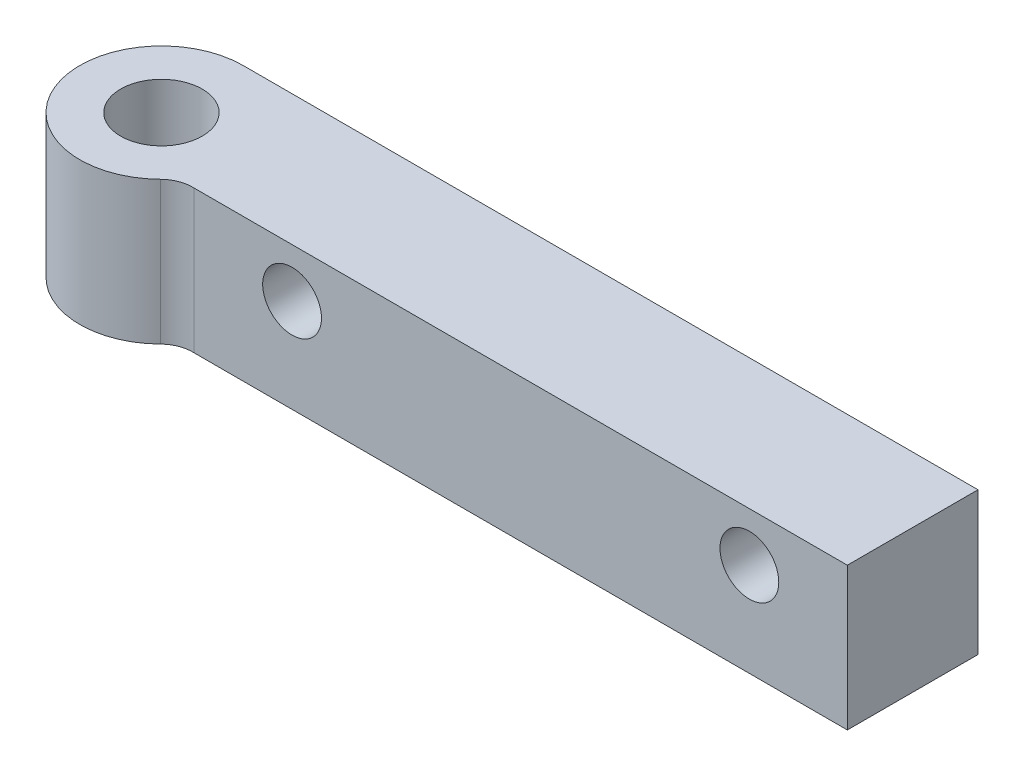
ISO-10303-21;
HEADER;
FILE_DESCRIPTION(('STEP AP214'),'2;1');
FILE_NAME('part.step','',(''),(''),'','','');
FILE_SCHEMA(('AUTOMOTIVE_DESIGN { 1 0 10303 214 1 1 1 1 }'));
ENDSEC;
DATA;
#1=APPLICATION_CONTEXT('core data for automotive mechanical design processes');
#2=APPLICATION_PROTOCOL_DEFINITION('international standard','automotive_design',2000,#1);
#3=PRODUCT_CONTEXT('',#1,'mechanical');
#4=PRODUCT('Part','Part','',(#3));
#5=PRODUCT_RELATED_PRODUCT_CATEGORY('part','',(#4));
#6=PRODUCT_DEFINITION_FORMATION('','',#4);
#7=PRODUCT_DEFINITION_CONTEXT('part definition',#1,'design');
#8=PRODUCT_DEFINITION('design','',#6,#7);
#9=PRODUCT_DEFINITION_SHAPE('','',#8);
#10=(LENGTH_UNIT() NAMED_UNIT(*) SI_UNIT(.MILLI.,.METRE.));
#11=(NAMED_UNIT(*) PLANE_ANGLE_UNIT() SI_UNIT($,.RADIAN.));
#12=(NAMED_UNIT(*) SI_UNIT($,.STERADIAN.) SOLID_ANGLE_UNIT());
#13=UNCERTAINTY_MEASURE_WITH_UNIT(LENGTH_MEASURE(1.E-05),#10,'distance_accuracy_value','');
#14=(GEOMETRIC_REPRESENTATION_CONTEXT(3) GLOBAL_UNCERTAINTY_ASSIGNED_CONTEXT((#13)) GLOBAL_UNIT_ASSIGNED_CONTEXT((#10,
#11,#12)) REPRESENTATION_CONTEXT('',''));
#15=CARTESIAN_POINT('',(0.,0.,0.));
#16=DIRECTION('',(0.,0.,1.));
#17=DIRECTION('',(1.,0.,0.));
#18=AXIS2_PLACEMENT_3D('',#15,#16,#17);
#19=CARTESIAN_POINT('',(0.,5.5499,0.));
#20=DIRECTION('',(0.,1.,0.));
#21=DIRECTION('',(0.,0.,1.));
#22=AXIS2_PLACEMENT_3D('',#19,#20,#21);
#23=PLANE('',#22);
#24=DIRECTION('',(-1.,0.,0.));
#25=VECTOR('',#24,1.);
#26=CARTESIAN_POINT('',(12.3664598942496,5.5499,-6.35));
#27=LINE('',#26,#25);
#28=CARTESIAN_POINT('',(57.15,5.5499,-6.35));
#29=VERTEX_POINT('',#28);
#30=CARTESIAN_POINT('',(0.,5.5499,-6.35));
#31=VERTEX_POINT('',#30);
#32=EDGE_CURVE('E84',#29,#31,#27,.T.);
#33=ORIENTED_EDGE('',*,*,#32,.T.);
#34=CARTESIAN_POINT('',(0.,5.5499,0.));
#35=DIRECTION('',(0.,1.,0.));
#36=DIRECTION('',(0.,0.,1.));
#37=AXIS2_PLACEMENT_3D('',#34,#35,#36);
#38=CIRCLE('',#37,6.35);
#39=CARTESIAN_POINT('',(4.44632214198966,5.5499,4.53351071573151));
#40=VERTEX_POINT('',#39);
#41=EDGE_CURVE('E87',#31,#40,#38,.T.);
#42=ORIENTED_EDGE('',*,*,#41,.T.);
#43=CARTESIAN_POINT('',(6.22485099878553,5.5499,6.34691500202412));
#44=DIRECTION('',(0.,1.,0.));
#45=DIRECTION('',(0.,0.,1.));
#46=AXIS2_PLACEMENT_3D('',#43,#44,#45);
#47=CIRCLE('',#46,2.54);
#48=CARTESIAN_POINT('',(6.35,5.5499,3.81));
#49=VERTEX_POINT('',#48);
#50=EDGE_CURVE('E11',#40,#49,#47,.F.);
#51=ORIENTED_EDGE('',*,*,#50,.T.);
#52=DIRECTION('',(1.,0.,0.));
#53=VECTOR('',#52,1.);
#54=CARTESIAN_POINT('',(6.35,5.5499,3.81));
#55=LINE('',#54,#53);
#56=CARTESIAN_POINT('',(57.15,5.5499,3.81));
#57=VERTEX_POINT('',#56);
#58=EDGE_CURVE('E103',#49,#57,#55,.T.);
#59=ORIENTED_EDGE('',*,*,#58,.T.);
#60=DIRECTION('',(0.,0.,-1.));
#61=VECTOR('',#60,1.);
#62=CARTESIAN_POINT('',(57.15,5.5499,-6.35));
#63=LINE('',#62,#61);
#64=EDGE_CURVE('E90',#57,#29,#63,.T.);
#65=ORIENTED_EDGE('',*,*,#64,.T.);
#66=EDGE_LOOP('',(#33,#42,#51,#59,#65));
#67=FACE_BOUND('',#66,.T.);
#68=CARTESIAN_POINT('',(0.,5.5499,0.));
#69=DIRECTION('',(0.,1.,0.));
#70=DIRECTION('',(0.,0.,1.));
#71=AXIS2_PLACEMENT_3D('',#68,#69,#70);
#72=CIRCLE('',#71,3.175);
#73=CARTESIAN_POINT('',(0.,5.5499,3.175));
#74=VERTEX_POINT('',#73);
#75=EDGE_CURVE('E112',#74,#74,#72,.T.);
#76=ORIENTED_EDGE('',*,*,#75,.F.);
#77=EDGE_LOOP('',(#76));
#78=FACE_BOUND('',#77,.T.);
#79=ADVANCED_FACE('F38',(#67,#78),#23,.T.);
#80=CARTESIAN_POINT('',(0.,-5.5499,0.));
#81=DIRECTION('',(0.,1.,0.));
#82=DIRECTION('',(0.,0.,1.));
#83=AXIS2_PLACEMENT_3D('',#80,#81,#82);
#84=PLANE('',#83);
#85=DIRECTION('',(-1.,0.,0.));
#86=VECTOR('',#85,1.);
#87=CARTESIAN_POINT('',(0.,-5.5499,-6.35));
#88=LINE('',#87,#86);
#89=CARTESIAN_POINT('',(57.15,-5.5499,-6.35));
#90=VERTEX_POINT('',#89);
#91=CARTESIAN_POINT('',(0.,-5.5499,-6.35));
#92=VERTEX_POINT('',#91);
#93=EDGE_CURVE('E99',#90,#92,#88,.T.);
#94=ORIENTED_EDGE('',*,*,#93,.F.);
#95=DIRECTION('',(0.,0.,-1.));
#96=VECTOR('',#95,1.);
#97=CARTESIAN_POINT('',(57.15,-5.5499,-6.35));
#98=LINE('',#97,#96);
#99=CARTESIAN_POINT('',(57.15,-5.5499,3.81));
#100=VERTEX_POINT('',#99);
#101=EDGE_CURVE('E94',#100,#90,#98,.T.);
#102=ORIENTED_EDGE('',*,*,#101,.F.);
#103=DIRECTION('',(1.,0.,0.));
#104=VECTOR('',#103,1.);
#105=CARTESIAN_POINT('',(6.35,-5.5499,3.81));
#106=LINE('',#105,#104);
#107=CARTESIAN_POINT('',(6.35,-5.5499,3.81));
#108=VERTEX_POINT('',#107);
#109=EDGE_CURVE('E114',#108,#100,#106,.T.);
#110=ORIENTED_EDGE('',*,*,#109,.F.);
#111=CARTESIAN_POINT('',(6.22485099878553,-5.5499,6.34691500202412));
#112=DIRECTION('',(0.,1.,0.));
#113=DIRECTION('',(0.,0.,1.));
#114=AXIS2_PLACEMENT_3D('',#111,#112,#113);
#115=CIRCLE('',#114,2.54);
#116=CARTESIAN_POINT('',(4.44632214198966,-5.5499,4.53351071573151));
#117=VERTEX_POINT('',#116);
#118=EDGE_CURVE('E46',#108,#117,#115,.T.);
#119=ORIENTED_EDGE('',*,*,#118,.T.);
#120=CARTESIAN_POINT('',(0.,-5.5499,0.));
#121=DIRECTION('',(0.,1.,0.));
#122=DIRECTION('',(0.,0.,1.));
#123=AXIS2_PLACEMENT_3D('',#120,#121,#122);
#124=CIRCLE('',#123,6.35);
#125=EDGE_CURVE('E111',#92,#117,#124,.T.);
#126=ORIENTED_EDGE('',*,*,#125,.F.);
#127=EDGE_LOOP('',(#94,#102,#110,#119,#126));
#128=FACE_BOUND('',#127,.T.);
#129=CARTESIAN_POINT('',(0.,-5.5499,0.));
#130=DIRECTION('',(0.,1.,0.));
#131=DIRECTION('',(0.,0.,1.));
#132=AXIS2_PLACEMENT_3D('',#129,#130,#131);
#133=CIRCLE('',#132,3.175);
#134=CARTESIAN_POINT('',(0.,-5.5499,3.175));
#135=VERTEX_POINT('',#134);
#136=EDGE_CURVE('E174',#135,#135,#133,.T.);
#137=ORIENTED_EDGE('',*,*,#136,.T.);
#138=EDGE_LOOP('',(#137));
#139=FACE_BOUND('',#138,.T.);
#140=ADVANCED_FACE('F131',(#128,#139),#84,.F.);
#141=CARTESIAN_POINT('',(0.,5.5499,-6.35));
#142=DIRECTION('',(0.,0.,1.));
#143=DIRECTION('',(1.,0.,0.));
#144=AXIS2_PLACEMENT_3D('',#141,#142,#143);
#145=PLANE('',#144);
#146=ORIENTED_EDGE('',*,*,#93,.T.);
#147=DIRECTION('',(0.,-1.,0.));
#148=VECTOR('',#147,1.);
#149=CARTESIAN_POINT('',(0.,5.5499,-6.35));
#150=LINE('',#149,#148);
#151=EDGE_CURVE('E97',#31,#92,#150,.T.);
#152=ORIENTED_EDGE('',*,*,#151,.F.);
#153=ORIENTED_EDGE('',*,*,#32,.F.);
#154=DIRECTION('',(0.,-1.,0.));
#155=VECTOR('',#154,1.);
#156=CARTESIAN_POINT('',(57.15,5.5499,-6.35));
#157=LINE('',#156,#155);
#158=EDGE_CURVE('E109',#29,#90,#157,.T.);
#159=ORIENTED_EDGE('',*,*,#158,.T.);
#160=EDGE_LOOP('',(#146,#152,#153,#159));
#161=FACE_BOUND('',#160,.T.);
#162=ADVANCED_FACE('F98',(#161),#145,.F.);
#163=CARTESIAN_POINT('',(0.,5.5499,0.));
#164=DIRECTION('',(0.,-1.,0.));
#165=DIRECTION('',(0.,0.,-1.));
#166=AXIS2_PLACEMENT_3D('',#163,#164,#165);
#167=CYLINDRICAL_SURFACE('',#166,6.35);
#168=ORIENTED_EDGE('',*,*,#125,.T.);
#169=DIRECTION('',(0.,-1.,0.));
#170=VECTOR('',#169,1.);
#171=CARTESIAN_POINT('',(4.44632214198966,5.5499,4.53351071573151));
#172=LINE('',#171,#170);
#173=EDGE_CURVE('E53',#117,#40,#172,.F.);
#174=ORIENTED_EDGE('',*,*,#173,.T.);
#175=ORIENTED_EDGE('',*,*,#41,.F.);
#176=ORIENTED_EDGE('',*,*,#151,.T.);
#177=EDGE_LOOP('',(#168,#174,#175,#176));
#178=FACE_BOUND('',#177,.T.);
#179=ADVANCED_FACE('F102',(#178),#167,.T.);
#180=CARTESIAN_POINT('',(6.35,5.5499,3.81));
#181=DIRECTION('',(0.,0.,-1.));
#182=DIRECTION('',(-1.,0.,0.));
#183=AXIS2_PLACEMENT_3D('',#180,#181,#182);
#184=PLANE('',#183);
#185=CARTESIAN_POINT('',(13.9700000000017,1.73989999999999,3.81));
#186=DIRECTION('',(0.,0.,1.));
#187=DIRECTION('',(1.,0.,0.));
#188=AXIS2_PLACEMENT_3D('',#185,#186,#187);
#189=CIRCLE('',#188,2.28599999999841);
#190=CARTESIAN_POINT('',(16.2560000000001,1.73989999999999,3.81));
#191=VERTEX_POINT('',#190);
#192=EDGE_CURVE('E175',#191,#191,#189,.T.);
#193=ORIENTED_EDGE('',*,*,#192,.F.);
#194=EDGE_LOOP('',(#193));
#195=FACE_BOUND('',#194,.T.);
#196=CARTESIAN_POINT('',(49.5300000000017,1.73989999999999,3.81));
#197=DIRECTION('',(0.,0.,1.));
#198=DIRECTION('',(1.,0.,0.));
#199=AXIS2_PLACEMENT_3D('',#196,#197,#198);
#200=CIRCLE('',#199,2.28599999999841);
#201=CARTESIAN_POINT('',(51.8160000000001,1.73989999999999,3.81));
#202=VERTEX_POINT('',#201);
#203=EDGE_CURVE('E184',#202,#202,#200,.T.);
#204=ORIENTED_EDGE('',*,*,#203,.F.);
#205=EDGE_LOOP('',(#204));
#206=FACE_BOUND('',#205,.T.);
#207=ORIENTED_EDGE('',*,*,#109,.T.);
#208=DIRECTION('',(0.,-1.,0.));
#209=VECTOR('',#208,1.);
#210=CARTESIAN_POINT('',(57.15,5.5499,3.81));
#211=LINE('',#210,#209);
#212=EDGE_CURVE('E119',#57,#100,#211,.T.);
#213=ORIENTED_EDGE('',*,*,#212,.F.);
#214=ORIENTED_EDGE('',*,*,#58,.F.);
#215=DIRECTION('',(0.,-1.,0.));
#216=VECTOR('',#215,1.);
#217=CARTESIAN_POINT('',(6.35,5.5499,3.81));
#218=LINE('',#217,#216);
#219=EDGE_CURVE('E100',#49,#108,#218,.T.);
#220=ORIENTED_EDGE('',*,*,#219,.T.);
#221=EDGE_LOOP('',(#207,#213,#214,#220));
#222=FACE_BOUND('',#221,.T.);
#223=ADVANCED_FACE('F127',(#195,#206,#222),#184,.F.);
#224=CARTESIAN_POINT('',(57.15,5.5499,-6.35));
#225=DIRECTION('',(-1.,0.,0.));
#226=DIRECTION('',(0.,0.,1.));
#227=AXIS2_PLACEMENT_3D('',#224,#225,#226);
#228=PLANE('',#227);
#229=ORIENTED_EDGE('',*,*,#101,.T.);
#230=ORIENTED_EDGE('',*,*,#158,.F.);
#231=ORIENTED_EDGE('',*,*,#64,.F.);
#232=ORIENTED_EDGE('',*,*,#212,.T.);
#233=EDGE_LOOP('',(#229,#230,#231,#232));
#234=FACE_BOUND('',#233,.T.);
#235=ADVANCED_FACE('F134',(#234),#228,.F.);
#236=CARTESIAN_POINT('',(0.,5.5499,0.));
#237=DIRECTION('',(0.,-1.,0.));
#238=DIRECTION('',(0.,0.,-1.));
#239=AXIS2_PLACEMENT_3D('',#236,#237,#238);
#240=CYLINDRICAL_SURFACE('',#239,3.175);
#241=ORIENTED_EDGE('',*,*,#75,.T.);
#242=EDGE_LOOP('',(#241));
#243=FACE_BOUND('',#242,.T.);
#244=ORIENTED_EDGE('',*,*,#136,.F.);
#245=EDGE_LOOP('',(#244));
#246=FACE_BOUND('',#245,.T.);
#247=ADVANCED_FACE('F136',(#243,#246),#240,.F.);
#248=CARTESIAN_POINT('',(6.22485099878553,5.5499,6.34691500202412));
#249=DIRECTION('',(0.,1.,0.));
#250=DIRECTION('',(0.,0.,1.));
#251=AXIS2_PLACEMENT_3D('',#248,#249,#250);
#252=CYLINDRICAL_SURFACE('',#251,2.54);
#253=ORIENTED_EDGE('',*,*,#50,.F.);
#254=ORIENTED_EDGE('',*,*,#173,.F.);
#255=ORIENTED_EDGE('',*,*,#118,.F.);
#256=ORIENTED_EDGE('',*,*,#219,.F.);
#257=EDGE_LOOP('',(#253,#254,#255,#256));
#258=FACE_BOUND('',#257,.T.);
#259=ADVANCED_FACE('F40',(#258),#252,.F.);
#260=CARTESIAN_POINT('',(49.5300000000017,1.73989999999999,-1.27));
#261=DIRECTION('',(0.,0.,1.));
#262=DIRECTION('',(1.,0.,0.));
#263=AXIS2_PLACEMENT_3D('',#260,#261,#262);
#264=CYLINDRICAL_SURFACE('',#263,2.28599999999841);
#265=CARTESIAN_POINT('',(49.5300000000017,1.73989999999999,-1.27));
#266=DIRECTION('',(0.,0.,1.));
#267=DIRECTION('',(1.,0.,0.));
#268=AXIS2_PLACEMENT_3D('',#265,#266,#267);
#269=CIRCLE('',#268,2.28599999999841);
#270=CARTESIAN_POINT('',(51.8160000000001,1.73989999999999,-1.27));
#271=VERTEX_POINT('',#270);
#272=EDGE_CURVE('E179',#271,#271,#269,.T.);
#273=ORIENTED_EDGE('',*,*,#272,.F.);
#274=EDGE_LOOP('',(#273));
#275=FACE_BOUND('',#274,.T.);
#276=ORIENTED_EDGE('',*,*,#203,.T.);
#277=EDGE_LOOP('',(#276));
#278=FACE_BOUND('',#277,.T.);
#279=ADVANCED_FACE('F154',(#275,#278),#264,.F.);
#280=CARTESIAN_POINT('',(0.,0.,-1.27));
#281=DIRECTION('',(0.,0.,1.));
#282=DIRECTION('',(1.,0.,0.));
#283=AXIS2_PLACEMENT_3D('',#280,#281,#282);
#284=PLANE('',#283);
#285=ORIENTED_EDGE('',*,*,#272,.T.);
#286=EDGE_LOOP('',(#285));
#287=FACE_BOUND('',#286,.T.);
#288=ADVANCED_FACE('F157',(#287),#284,.T.);
#289=CARTESIAN_POINT('',(13.9700000000017,1.73989999999999,-1.27));
#290=DIRECTION('',(0.,0.,1.));
#291=DIRECTION('',(1.,0.,0.));
#292=AXIS2_PLACEMENT_3D('',#289,#290,#291);
#293=CYLINDRICAL_SURFACE('',#292,2.28599999999841);
#294=CARTESIAN_POINT('',(13.9700000000017,1.73989999999999,-1.27));
#295=DIRECTION('',(0.,0.,1.));
#296=DIRECTION('',(1.,0.,0.));
#297=AXIS2_PLACEMENT_3D('',#294,#295,#296);
#298=CIRCLE('',#297,2.28599999999841);
#299=CARTESIAN_POINT('',(16.2560000000001,1.73989999999999,-1.27));
#300=VERTEX_POINT('',#299);
#301=EDGE_CURVE('E173',#300,#300,#298,.T.);
#302=ORIENTED_EDGE('',*,*,#301,.F.);
#303=EDGE_LOOP('',(#302));
#304=FACE_BOUND('',#303,.T.);
#305=ORIENTED_EDGE('',*,*,#192,.T.);
#306=EDGE_LOOP('',(#305));
#307=FACE_BOUND('',#306,.T.);
#308=ADVANCED_FACE('F161',(#304,#307),#293,.F.);
#309=CARTESIAN_POINT('',(0.,0.,-1.27));
#310=DIRECTION('',(0.,0.,1.));
#311=DIRECTION('',(1.,0.,0.));
#312=AXIS2_PLACEMENT_3D('',#309,#310,#311);
#313=PLANE('',#312);
#314=ORIENTED_EDGE('',*,*,#301,.T.);
#315=EDGE_LOOP('',(#314));
#316=FACE_BOUND('',#315,.T.);
#317=ADVANCED_FACE('F165',(#316),#313,.T.);
#318=CLOSED_SHELL('',(#79,#140,#162,#179,#223,#235,#247,#259,#279,#288,#308,#317));
#319=MANIFOLD_SOLID_BREP('B2',#318);
#320=ADVANCED_BREP_SHAPE_REPRESENTATION('',(#18,#319),#14);
#321=SHAPE_DEFINITION_REPRESENTATION(#9,#320);
ENDSEC;
END-ISO-10303-21;
